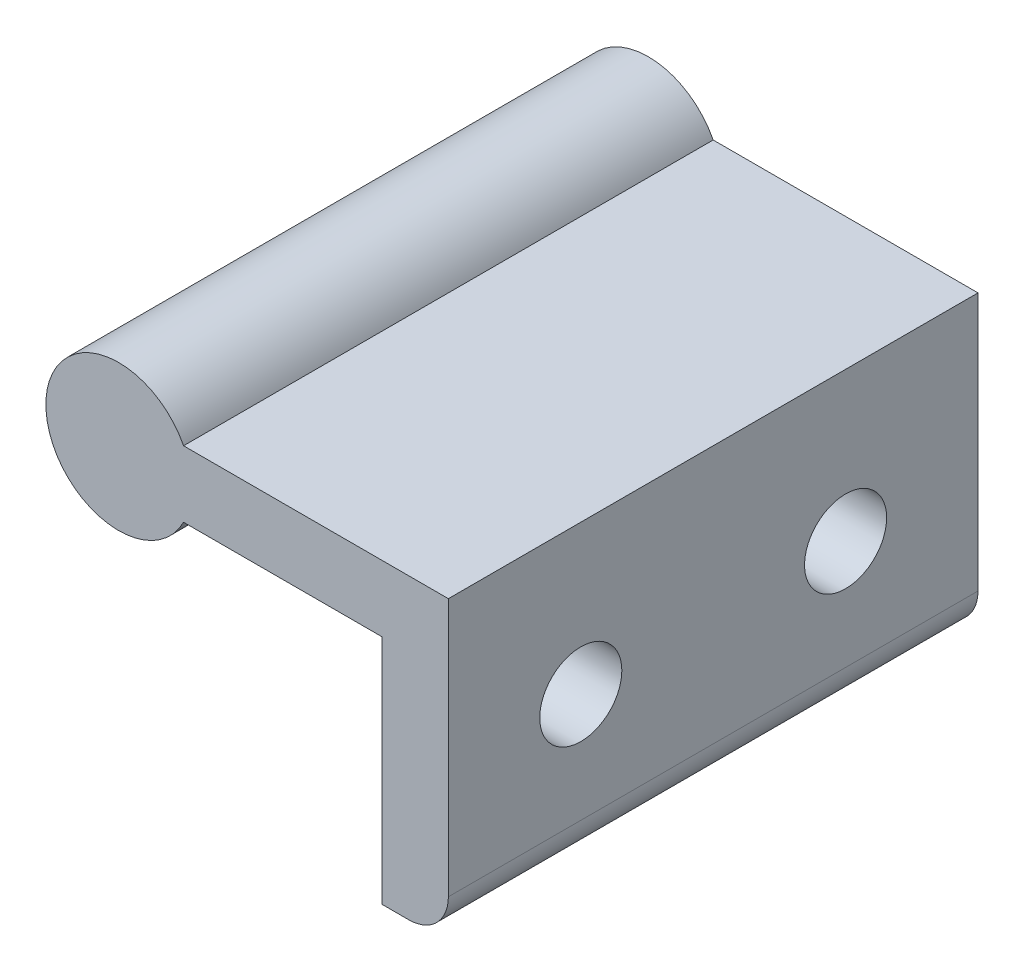
ISO-10303-21;
HEADER;
FILE_DESCRIPTION(('STEP AP214'),'2;1');
FILE_NAME('part.step','',(''),(''),'','','');
FILE_SCHEMA(('AUTOMOTIVE_DESIGN { 1 0 10303 214 1 1 1 1 }'));
ENDSEC;
DATA;
#1=APPLICATION_CONTEXT('core data for automotive mechanical design processes');
#2=APPLICATION_PROTOCOL_DEFINITION('international standard','automotive_design',2000,#1);
#3=PRODUCT_CONTEXT('',#1,'mechanical');
#4=PRODUCT('Part','Part','',(#3));
#5=PRODUCT_RELATED_PRODUCT_CATEGORY('part','',(#4));
#6=PRODUCT_DEFINITION_FORMATION('','',#4);
#7=PRODUCT_DEFINITION_CONTEXT('part definition',#1,'design');
#8=PRODUCT_DEFINITION('design','',#6,#7);
#9=PRODUCT_DEFINITION_SHAPE('','',#8);
#10=(LENGTH_UNIT() NAMED_UNIT(*) SI_UNIT(.MILLI.,.METRE.));
#11=(NAMED_UNIT(*) PLANE_ANGLE_UNIT() SI_UNIT($,.RADIAN.));
#12=(NAMED_UNIT(*) SI_UNIT($,.STERADIAN.) SOLID_ANGLE_UNIT());
#13=UNCERTAINTY_MEASURE_WITH_UNIT(LENGTH_MEASURE(1.E-05),#10,'distance_accuracy_value','');
#14=(GEOMETRIC_REPRESENTATION_CONTEXT(3) GLOBAL_UNCERTAINTY_ASSIGNED_CONTEXT((#13)) GLOBAL_UNIT_ASSIGNED_CONTEXT((#10,
#11,#12)) REPRESENTATION_CONTEXT('',''));
#15=CARTESIAN_POINT('',(0.,0.,0.));
#16=DIRECTION('',(0.,0.,1.));
#17=DIRECTION('',(1.,0.,0.));
#18=AXIS2_PLACEMENT_3D('',#15,#16,#17);
#19=CARTESIAN_POINT('',(0.,-20.,40.));
#20=DIRECTION('',(0.,-1.,0.));
#21=DIRECTION('',(0.,0.,-1.));
#22=AXIS2_PLACEMENT_3D('',#19,#20,#21);
#23=PLANE('',#22);
#24=DIRECTION('',(-1.,0.,0.));
#25=VECTOR('',#24,1.);
#26=CARTESIAN_POINT('',(0.,-20.,0.));
#27=LINE('',#26,#25);
#28=CARTESIAN_POINT('',(21.8989794855664,-20.,0.));
#29=VERTEX_POINT('',#28);
#30=CARTESIAN_POINT('',(19.8989794855664,-20.,0.));
#31=VERTEX_POINT('',#30);
#32=EDGE_CURVE('E124',#29,#31,#27,.T.);
#33=ORIENTED_EDGE('',*,*,#32,.F.);
#34=DIRECTION('',(0.,0.,-1.));
#35=VECTOR('',#34,1.);
#36=CARTESIAN_POINT('',(21.8989794855664,-20.,40.));
#37=LINE('',#36,#35);
#38=CARTESIAN_POINT('',(21.8989794855664,-20.,40.));
#39=VERTEX_POINT('',#38);
#40=EDGE_CURVE('E41',#29,#39,#37,.F.);
#41=ORIENTED_EDGE('',*,*,#40,.T.);
#42=DIRECTION('',(-1.,0.,0.));
#43=VECTOR('',#42,1.);
#44=CARTESIAN_POINT('',(0.,-20.,40.));
#45=LINE('',#44,#43);
#46=CARTESIAN_POINT('',(19.8989794855664,-20.,40.));
#47=VERTEX_POINT('',#46);
#48=EDGE_CURVE('E109',#39,#47,#45,.T.);
#49=ORIENTED_EDGE('',*,*,#48,.T.);
#50=DIRECTION('',(0.,0.,-1.));
#51=VECTOR('',#50,1.);
#52=CARTESIAN_POINT('',(19.8989794855664,-20.,40.));
#53=LINE('',#52,#51);
#54=EDGE_CURVE('E123',#47,#31,#53,.T.);
#55=ORIENTED_EDGE('',*,*,#54,.T.);
#56=EDGE_LOOP('',(#33,#41,#49,#55));
#57=FACE_BOUND('',#56,.T.);
#58=ADVANCED_FACE('F33',(#57),#23,.T.);
#59=CARTESIAN_POINT('',(24.8989794855664,0.,40.));
#60=DIRECTION('',(1.,0.,0.));
#61=DIRECTION('',(0.,0.,-1.));
#62=AXIS2_PLACEMENT_3D('',#59,#60,#61);
#63=PLANE('',#62);
#64=CARTESIAN_POINT('',(24.8989794855664,-8.75,30.));
#65=DIRECTION('',(1.,0.,0.));
#66=DIRECTION('',(0.,0.,-1.));
#67=AXIS2_PLACEMENT_3D('',#64,#65,#66);
#68=CIRCLE('',#67,3.1);
#69=CARTESIAN_POINT('',(24.8989794855664,-8.75,26.9));
#70=VERTEX_POINT('',#69);
#71=EDGE_CURVE('E149',#70,#70,#68,.T.);
#72=ORIENTED_EDGE('',*,*,#71,.F.);
#73=EDGE_LOOP('',(#72));
#74=FACE_BOUND('',#73,.T.);
#75=CARTESIAN_POINT('',(24.8989794855664,-8.75,10.));
#76=DIRECTION('',(1.,0.,0.));
#77=DIRECTION('',(0.,0.,-1.));
#78=AXIS2_PLACEMENT_3D('',#75,#76,#77);
#79=CIRCLE('',#78,3.1);
#80=CARTESIAN_POINT('',(24.8989794855664,-8.75,6.9));
#81=VERTEX_POINT('',#80);
#82=EDGE_CURVE('E170',#81,#81,#79,.T.);
#83=ORIENTED_EDGE('',*,*,#82,.F.);
#84=EDGE_LOOP('',(#83));
#85=FACE_BOUND('',#84,.T.);
#86=DIRECTION('',(0.,-1.,0.));
#87=VECTOR('',#86,1.);
#88=CARTESIAN_POINT('',(24.8989794855664,0.,40.));
#89=LINE('',#88,#87);
#90=CARTESIAN_POINT('',(24.8989794855664,2.5,40.));
#91=VERTEX_POINT('',#90);
#92=CARTESIAN_POINT('',(24.8989794855664,-17.,40.));
#93=VERTEX_POINT('',#92);
#94=EDGE_CURVE('E94',#91,#93,#89,.T.);
#95=ORIENTED_EDGE('',*,*,#94,.T.);
#96=DIRECTION('',(0.,0.,-1.));
#97=VECTOR('',#96,1.);
#98=CARTESIAN_POINT('',(24.8989794855664,-17.,40.));
#99=LINE('',#98,#97);
#100=CARTESIAN_POINT('',(24.8989794855664,-17.,0.));
#101=VERTEX_POINT('',#100);
#102=EDGE_CURVE('E101',#93,#101,#99,.T.);
#103=ORIENTED_EDGE('',*,*,#102,.T.);
#104=DIRECTION('',(0.,-1.,0.));
#105=VECTOR('',#104,1.);
#106=CARTESIAN_POINT('',(24.8989794855664,0.,0.));
#107=LINE('',#106,#105);
#108=CARTESIAN_POINT('',(24.8989794855664,2.5,0.));
#109=VERTEX_POINT('',#108);
#110=EDGE_CURVE('E96',#109,#101,#107,.T.);
#111=ORIENTED_EDGE('',*,*,#110,.F.);
#112=DIRECTION('',(0.,0.,-1.));
#113=VECTOR('',#112,1.);
#114=CARTESIAN_POINT('',(24.8989794855664,2.5,40.));
#115=LINE('',#114,#113);
#116=EDGE_CURVE('E90',#91,#109,#115,.T.);
#117=ORIENTED_EDGE('',*,*,#116,.F.);
#118=EDGE_LOOP('',(#95,#103,#111,#117));
#119=FACE_BOUND('',#118,.T.);
#120=ADVANCED_FACE('F92',(#74,#85,#119),#63,.T.);
#121=CARTESIAN_POINT('',(0.,2.5,40.));
#122=DIRECTION('',(0.,1.,0.));
#123=DIRECTION('',(0.,0.,1.));
#124=AXIS2_PLACEMENT_3D('',#121,#122,#123);
#125=PLANE('',#124);
#126=DIRECTION('',(1.,0.,0.));
#127=VECTOR('',#126,1.);
#128=CARTESIAN_POINT('',(0.,2.5,0.));
#129=LINE('',#128,#127);
#130=CARTESIAN_POINT('',(4.89897948556636,2.5,0.));
#131=VERTEX_POINT('',#130);
#132=EDGE_CURVE('E128',#131,#109,#129,.T.);
#133=ORIENTED_EDGE('',*,*,#132,.F.);
#134=DIRECTION('',(0.,0.,-1.));
#135=VECTOR('',#134,1.);
#136=CARTESIAN_POINT('',(4.89897948556636,2.5,40.));
#137=LINE('',#136,#135);
#138=CARTESIAN_POINT('',(4.89897948556636,2.5,40.));
#139=VERTEX_POINT('',#138);
#140=EDGE_CURVE('E102',#139,#131,#137,.T.);
#141=ORIENTED_EDGE('',*,*,#140,.F.);
#142=DIRECTION('',(1.,0.,0.));
#143=VECTOR('',#142,1.);
#144=CARTESIAN_POINT('',(0.,2.5,40.));
#145=LINE('',#144,#143);
#146=EDGE_CURVE('E107',#139,#91,#145,.T.);
#147=ORIENTED_EDGE('',*,*,#146,.T.);
#148=ORIENTED_EDGE('',*,*,#116,.T.);
#149=EDGE_LOOP('',(#133,#141,#147,#148));
#150=FACE_BOUND('',#149,.T.);
#151=ADVANCED_FACE('F111',(#150),#125,.T.);
#152=CARTESIAN_POINT('',(0.,0.,40.));
#153=DIRECTION('',(0.,0.,-1.));
#154=DIRECTION('',(-1.,0.,0.));
#155=AXIS2_PLACEMENT_3D('',#152,#153,#154);
#156=CYLINDRICAL_SURFACE('',#155,5.5);
#157=CARTESIAN_POINT('',(0.,0.,0.));
#158=DIRECTION('',(0.,0.,1.));
#159=DIRECTION('',(1.,0.,0.));
#160=AXIS2_PLACEMENT_3D('',#157,#158,#159);
#161=CIRCLE('',#160,5.5);
#162=CARTESIAN_POINT('',(4.89897948556636,-2.5,0.));
#163=VERTEX_POINT('',#162);
#164=EDGE_CURVE('E130',#131,#163,#161,.T.);
#165=ORIENTED_EDGE('',*,*,#164,.T.);
#166=DIRECTION('',(0.,0.,-1.));
#167=VECTOR('',#166,1.);
#168=CARTESIAN_POINT('',(4.89897948556636,-2.5,40.));
#169=LINE('',#168,#167);
#170=CARTESIAN_POINT('',(4.89897948556636,-2.5,40.));
#171=VERTEX_POINT('',#170);
#172=EDGE_CURVE('E142',#171,#163,#169,.T.);
#173=ORIENTED_EDGE('',*,*,#172,.F.);
#174=CARTESIAN_POINT('',(0.,0.,40.));
#175=DIRECTION('',(0.,0.,1.));
#176=DIRECTION('',(1.,0.,0.));
#177=AXIS2_PLACEMENT_3D('',#174,#175,#176);
#178=CIRCLE('',#177,5.5);
#179=EDGE_CURVE('E113',#139,#171,#178,.T.);
#180=ORIENTED_EDGE('',*,*,#179,.F.);
#181=ORIENTED_EDGE('',*,*,#140,.T.);
#182=EDGE_LOOP('',(#165,#173,#180,#181));
#183=FACE_BOUND('',#182,.T.);
#184=ADVANCED_FACE('F160',(#183),#156,.T.);
#185=CARTESIAN_POINT('',(0.,-2.5,40.));
#186=DIRECTION('',(0.,1.,0.));
#187=DIRECTION('',(0.,0.,1.));
#188=AXIS2_PLACEMENT_3D('',#185,#186,#187);
#189=PLANE('',#188);
#190=DIRECTION('',(1.,0.,0.));
#191=VECTOR('',#190,1.);
#192=CARTESIAN_POINT('',(0.,-2.5,0.));
#193=LINE('',#192,#191);
#194=CARTESIAN_POINT('',(19.8989794855664,-2.5,0.));
#195=VERTEX_POINT('',#194);
#196=EDGE_CURVE('E132',#163,#195,#193,.T.);
#197=ORIENTED_EDGE('',*,*,#196,.T.);
#198=DIRECTION('',(0.,0.,-1.));
#199=VECTOR('',#198,1.);
#200=CARTESIAN_POINT('',(19.8989794855664,-2.5,40.));
#201=LINE('',#200,#199);
#202=CARTESIAN_POINT('',(19.8989794855664,-2.5,40.));
#203=VERTEX_POINT('',#202);
#204=EDGE_CURVE('E139',#203,#195,#201,.T.);
#205=ORIENTED_EDGE('',*,*,#204,.F.);
#206=DIRECTION('',(1.,0.,0.));
#207=VECTOR('',#206,1.);
#208=CARTESIAN_POINT('',(0.,-2.5,40.));
#209=LINE('',#208,#207);
#210=EDGE_CURVE('E115',#171,#203,#209,.T.);
#211=ORIENTED_EDGE('',*,*,#210,.F.);
#212=ORIENTED_EDGE('',*,*,#172,.T.);
#213=EDGE_LOOP('',(#197,#205,#211,#212));
#214=FACE_BOUND('',#213,.T.);
#215=ADVANCED_FACE('F163',(#214),#189,.F.);
#216=CARTESIAN_POINT('',(19.8989794855664,0.,40.));
#217=DIRECTION('',(1.,0.,0.));
#218=DIRECTION('',(0.,1.,0.));
#219=AXIS2_PLACEMENT_3D('',#216,#217,#218);
#220=PLANE('',#219);
#221=CARTESIAN_POINT('',(19.8989794855664,-8.75,30.));
#222=DIRECTION('',(1.,0.,0.));
#223=DIRECTION('',(0.,1.,0.));
#224=AXIS2_PLACEMENT_3D('',#221,#222,#223);
#225=CIRCLE('',#224,3.1);
#226=CARTESIAN_POINT('',(19.8989794855664,-5.65,30.));
#227=VERTEX_POINT('',#226);
#228=EDGE_CURVE('E126',#227,#227,#225,.T.);
#229=ORIENTED_EDGE('',*,*,#228,.T.);
#230=EDGE_LOOP('',(#229));
#231=FACE_BOUND('',#230,.T.);
#232=CARTESIAN_POINT('',(19.8989794855664,-8.75,10.));
#233=DIRECTION('',(1.,0.,0.));
#234=DIRECTION('',(0.,1.,0.));
#235=AXIS2_PLACEMENT_3D('',#232,#233,#234);
#236=CIRCLE('',#235,3.1);
#237=CARTESIAN_POINT('',(19.8989794855664,-5.65,10.));
#238=VERTEX_POINT('',#237);
#239=EDGE_CURVE('E146',#238,#238,#236,.T.);
#240=ORIENTED_EDGE('',*,*,#239,.T.);
#241=EDGE_LOOP('',(#240));
#242=FACE_BOUND('',#241,.T.);
#243=DIRECTION('',(0.,-1.,0.));
#244=VECTOR('',#243,1.);
#245=CARTESIAN_POINT('',(19.8989794855664,0.,0.));
#246=LINE('',#245,#244);
#247=EDGE_CURVE('E134',#195,#31,#246,.T.);
#248=ORIENTED_EDGE('',*,*,#247,.T.);
#249=ORIENTED_EDGE('',*,*,#54,.F.);
#250=DIRECTION('',(0.,-1.,0.));
#251=VECTOR('',#250,1.);
#252=CARTESIAN_POINT('',(19.8989794855664,0.,40.));
#253=LINE('',#252,#251);
#254=EDGE_CURVE('E120',#203,#47,#253,.T.);
#255=ORIENTED_EDGE('',*,*,#254,.F.);
#256=ORIENTED_EDGE('',*,*,#204,.T.);
#257=EDGE_LOOP('',(#248,#249,#255,#256));
#258=FACE_BOUND('',#257,.T.);
#259=ADVANCED_FACE('F168',(#231,#242,#258),#220,.F.);
#260=CARTESIAN_POINT('',(0.,0.,40.));
#261=DIRECTION('',(0.,0.,1.));
#262=DIRECTION('',(1.,0.,0.));
#263=AXIS2_PLACEMENT_3D('',#260,#261,#262);
#264=PLANE('',#263);
#265=ORIENTED_EDGE('',*,*,#48,.F.);
#266=CARTESIAN_POINT('',(21.8989794855664,-17.,40.));
#267=DIRECTION('',(0.,0.,1.));
#268=DIRECTION('',(1.,0.,0.));
#269=AXIS2_PLACEMENT_3D('',#266,#267,#268);
#270=CIRCLE('',#269,3.);
#271=EDGE_CURVE('E11',#39,#93,#270,.T.);
#272=ORIENTED_EDGE('',*,*,#271,.T.);
#273=ORIENTED_EDGE('',*,*,#94,.F.);
#274=ORIENTED_EDGE('',*,*,#146,.F.);
#275=ORIENTED_EDGE('',*,*,#179,.T.);
#276=ORIENTED_EDGE('',*,*,#210,.T.);
#277=ORIENTED_EDGE('',*,*,#254,.T.);
#278=EDGE_LOOP('',(#265,#272,#273,#274,#275,#276,#277));
#279=FACE_BOUND('',#278,.T.);
#280=ADVANCED_FACE('F106',(#279),#264,.T.);
#281=CARTESIAN_POINT('',(0.,0.,0.));
#282=DIRECTION('',(0.,0.,1.));
#283=DIRECTION('',(1.,0.,0.));
#284=AXIS2_PLACEMENT_3D('',#281,#282,#283);
#285=PLANE('',#284);
#286=ORIENTED_EDGE('',*,*,#110,.T.);
#287=CARTESIAN_POINT('',(21.8989794855664,-17.,0.));
#288=DIRECTION('',(0.,0.,1.));
#289=DIRECTION('',(1.,0.,0.));
#290=AXIS2_PLACEMENT_3D('',#287,#288,#289);
#291=CIRCLE('',#290,3.);
#292=EDGE_CURVE('E55',#101,#29,#291,.F.);
#293=ORIENTED_EDGE('',*,*,#292,.T.);
#294=ORIENTED_EDGE('',*,*,#32,.T.);
#295=ORIENTED_EDGE('',*,*,#247,.F.);
#296=ORIENTED_EDGE('',*,*,#196,.F.);
#297=ORIENTED_EDGE('',*,*,#164,.F.);
#298=ORIENTED_EDGE('',*,*,#132,.T.);
#299=EDGE_LOOP('',(#286,#293,#294,#295,#296,#297,#298));
#300=FACE_BOUND('',#299,.T.);
#301=ADVANCED_FACE('F154',(#300),#285,.F.);
#302=CARTESIAN_POINT('',(14.8989794855664,-8.75,10.));
#303=DIRECTION('',(1.,0.,0.));
#304=DIRECTION('',(0.,0.,-1.));
#305=AXIS2_PLACEMENT_3D('',#302,#303,#304);
#306=CYLINDRICAL_SURFACE('',#305,3.1);
#307=ORIENTED_EDGE('',*,*,#82,.T.);
#308=EDGE_LOOP('',(#307));
#309=FACE_BOUND('',#308,.T.);
#310=ORIENTED_EDGE('',*,*,#239,.F.);
#311=EDGE_LOOP('',(#310));
#312=FACE_BOUND('',#311,.T.);
#313=ADVANCED_FACE('F184',(#309,#312),#306,.F.);
#314=CARTESIAN_POINT('',(14.8989794855664,-8.75,30.));
#315=DIRECTION('',(1.,0.,0.));
#316=DIRECTION('',(0.,0.,-1.));
#317=AXIS2_PLACEMENT_3D('',#314,#315,#316);
#318=CYLINDRICAL_SURFACE('',#317,3.1);
#319=ORIENTED_EDGE('',*,*,#71,.T.);
#320=EDGE_LOOP('',(#319));
#321=FACE_BOUND('',#320,.T.);
#322=ORIENTED_EDGE('',*,*,#228,.F.);
#323=EDGE_LOOP('',(#322));
#324=FACE_BOUND('',#323,.T.);
#325=ADVANCED_FACE('F176',(#321,#324),#318,.F.);
#326=CARTESIAN_POINT('',(21.8989794855664,-17.,40.));
#327=DIRECTION('',(0.,0.,-1.));
#328=DIRECTION('',(-1.,0.,0.));
#329=AXIS2_PLACEMENT_3D('',#326,#327,#328);
#330=CYLINDRICAL_SURFACE('',#329,3.);
#331=ORIENTED_EDGE('',*,*,#271,.F.);
#332=ORIENTED_EDGE('',*,*,#40,.F.);
#333=ORIENTED_EDGE('',*,*,#292,.F.);
#334=ORIENTED_EDGE('',*,*,#102,.F.);
#335=EDGE_LOOP('',(#331,#332,#333,#334));
#336=FACE_BOUND('',#335,.T.);
#337=ADVANCED_FACE('F35',(#336),#330,.T.);
#338=CLOSED_SHELL('',(#58,#120,#151,#184,#215,#259,#280,#301,#313,#325,#337));
#339=MANIFOLD_SOLID_BREP('B2',#338);
#340=ADVANCED_BREP_SHAPE_REPRESENTATION('',(#18,#339),#14);
#341=SHAPE_DEFINITION_REPRESENTATION(#9,#340);
ENDSEC;
END-ISO-10303-21;
